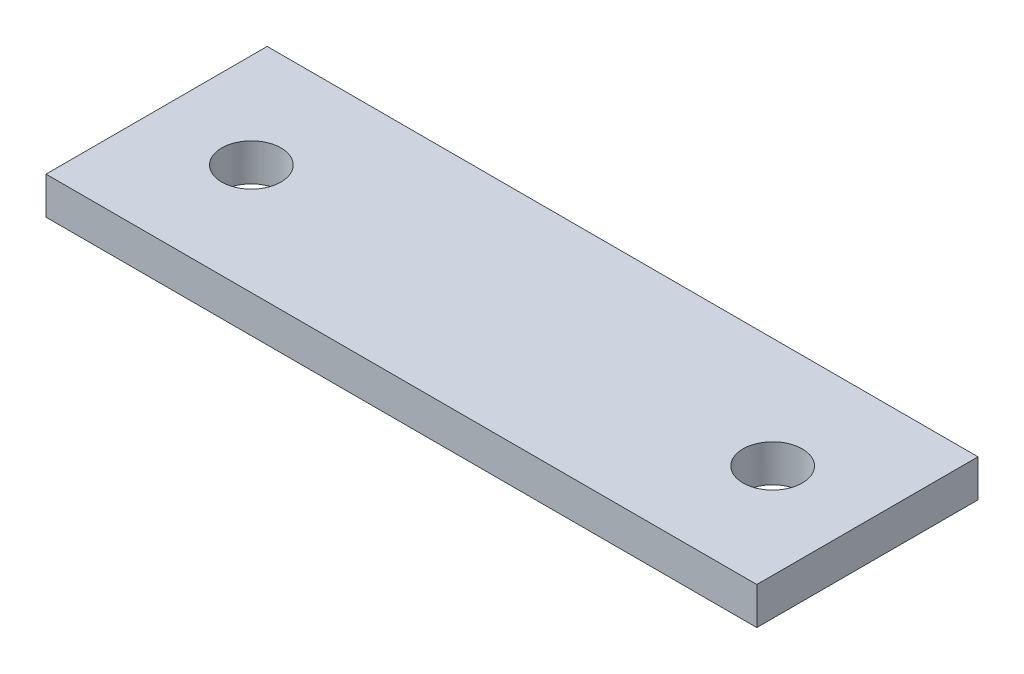
ISO-10303-21;
HEADER;
FILE_DESCRIPTION(('STEP AP214'),'2;1');
FILE_NAME('part.step','',(''),(''),'','','');
FILE_SCHEMA(('AUTOMOTIVE_DESIGN { 1 0 10303 214 1 1 1 1 }'));
ENDSEC;
DATA;
#1=APPLICATION_CONTEXT('core data for automotive mechanical design processes');
#2=APPLICATION_PROTOCOL_DEFINITION('international standard','automotive_design',2000,#1);
#3=PRODUCT_CONTEXT('',#1,'mechanical');
#4=PRODUCT('Part','Part','',(#3));
#5=PRODUCT_RELATED_PRODUCT_CATEGORY('part','',(#4));
#6=PRODUCT_DEFINITION_FORMATION('','',#4);
#7=PRODUCT_DEFINITION_CONTEXT('part definition',#1,'design');
#8=PRODUCT_DEFINITION('design','',#6,#7);
#9=PRODUCT_DEFINITION_SHAPE('','',#8);
#10=(LENGTH_UNIT() NAMED_UNIT(*) SI_UNIT(.MILLI.,.METRE.));
#11=(NAMED_UNIT(*) PLANE_ANGLE_UNIT() SI_UNIT($,.RADIAN.));
#12=(NAMED_UNIT(*) SI_UNIT($,.STERADIAN.) SOLID_ANGLE_UNIT());
#13=UNCERTAINTY_MEASURE_WITH_UNIT(LENGTH_MEASURE(1.E-05),#10,'distance_accuracy_value','');
#14=(GEOMETRIC_REPRESENTATION_CONTEXT(3) GLOBAL_UNCERTAINTY_ASSIGNED_CONTEXT((#13)) GLOBAL_UNIT_ASSIGNED_CONTEXT((#10,
#11,#12)) REPRESENTATION_CONTEXT('',''));
#15=CARTESIAN_POINT('',(0.,0.,0.));
#16=DIRECTION('',(0.,0.,1.));
#17=DIRECTION('',(1.,0.,0.));
#18=AXIS2_PLACEMENT_3D('',#15,#16,#17);
#19=CARTESIAN_POINT('',(0.,3.15,0.));
#20=DIRECTION('',(1.,0.,0.));
#21=DIRECTION('',(0.,0.,-1.));
#22=AXIS2_PLACEMENT_3D('',#19,#20,#21);
#23=PLANE('',#22);
#24=DIRECTION('',(0.,0.,1.));
#25=VECTOR('',#24,1.);
#26=CARTESIAN_POINT('',(0.,0.,0.));
#27=LINE('',#26,#25);
#28=CARTESIAN_POINT('',(0.,0.,-18.67));
#29=VERTEX_POINT('',#28);
#30=CARTESIAN_POINT('',(0.,0.,0.));
#31=VERTEX_POINT('',#30);
#32=EDGE_CURVE('E99',#29,#31,#27,.T.);
#33=ORIENTED_EDGE('',*,*,#32,.T.);
#34=DIRECTION('',(0.,-1.,0.));
#35=VECTOR('',#34,1.);
#36=CARTESIAN_POINT('',(0.,3.15,0.));
#37=LINE('',#36,#35);
#38=CARTESIAN_POINT('',(0.,3.15,0.));
#39=VERTEX_POINT('',#38);
#40=EDGE_CURVE('E11',#39,#31,#37,.T.);
#41=ORIENTED_EDGE('',*,*,#40,.F.);
#42=DIRECTION('',(0.,0.,1.));
#43=VECTOR('',#42,1.);
#44=CARTESIAN_POINT('',(0.,3.15,0.));
#45=LINE('',#44,#43);
#46=CARTESIAN_POINT('',(0.,3.15,-18.67));
#47=VERTEX_POINT('',#46);
#48=EDGE_CURVE('E87',#47,#39,#45,.T.);
#49=ORIENTED_EDGE('',*,*,#48,.F.);
#50=DIRECTION('',(0.,-1.,0.));
#51=VECTOR('',#50,1.);
#52=CARTESIAN_POINT('',(0.,3.15,-18.67));
#53=LINE('',#52,#51);
#54=EDGE_CURVE('E95',#47,#29,#53,.T.);
#55=ORIENTED_EDGE('',*,*,#54,.T.);
#56=EDGE_LOOP('',(#33,#41,#49,#55));
#57=FACE_BOUND('',#56,.T.);
#58=ADVANCED_FACE('F36',(#57),#23,.F.);
#59=CARTESIAN_POINT('',(0.,3.15,0.));
#60=DIRECTION('',(0.,0.,-1.));
#61=DIRECTION('',(-1.,0.,0.));
#62=AXIS2_PLACEMENT_3D('',#59,#60,#61);
#63=PLANE('',#62);
#64=DIRECTION('',(1.,0.,0.));
#65=VECTOR('',#64,1.);
#66=CARTESIAN_POINT('',(0.,0.,0.));
#67=LINE('',#66,#65);
#68=CARTESIAN_POINT('',(60.,0.,0.));
#69=VERTEX_POINT('',#68);
#70=EDGE_CURVE('E91',#31,#69,#67,.T.);
#71=ORIENTED_EDGE('',*,*,#70,.T.);
#72=DIRECTION('',(0.,-1.,0.));
#73=VECTOR('',#72,1.);
#74=CARTESIAN_POINT('',(60.,3.15,0.));
#75=LINE('',#74,#73);
#76=CARTESIAN_POINT('',(60.,3.15,0.));
#77=VERTEX_POINT('',#76);
#78=EDGE_CURVE('E44',#77,#69,#75,.T.);
#79=ORIENTED_EDGE('',*,*,#78,.F.);
#80=DIRECTION('',(1.,0.,0.));
#81=VECTOR('',#80,1.);
#82=CARTESIAN_POINT('',(0.,3.15,0.));
#83=LINE('',#82,#81);
#84=EDGE_CURVE('E82',#39,#77,#83,.T.);
#85=ORIENTED_EDGE('',*,*,#84,.F.);
#86=ORIENTED_EDGE('',*,*,#40,.T.);
#87=EDGE_LOOP('',(#71,#79,#85,#86));
#88=FACE_BOUND('',#87,.T.);
#89=ADVANCED_FACE('F90',(#88),#63,.F.);
#90=CARTESIAN_POINT('',(60.,3.15,0.));
#91=DIRECTION('',(-1.,0.,0.));
#92=DIRECTION('',(0.,0.,1.));
#93=AXIS2_PLACEMENT_3D('',#90,#91,#92);
#94=PLANE('',#93);
#95=DIRECTION('',(0.,0.,-1.));
#96=VECTOR('',#95,1.);
#97=CARTESIAN_POINT('',(60.,0.,0.));
#98=LINE('',#97,#96);
#99=CARTESIAN_POINT('',(60.,0.,-18.67));
#100=VERTEX_POINT('',#99);
#101=EDGE_CURVE('E69',#69,#100,#98,.T.);
#102=ORIENTED_EDGE('',*,*,#101,.T.);
#103=DIRECTION('',(0.,-1.,0.));
#104=VECTOR('',#103,1.);
#105=CARTESIAN_POINT('',(60.,3.15,-18.67));
#106=LINE('',#105,#104);
#107=CARTESIAN_POINT('',(60.,3.15,-18.67));
#108=VERTEX_POINT('',#107);
#109=EDGE_CURVE('E92',#108,#100,#106,.T.);
#110=ORIENTED_EDGE('',*,*,#109,.F.);
#111=DIRECTION('',(0.,0.,-1.));
#112=VECTOR('',#111,1.);
#113=CARTESIAN_POINT('',(60.,3.15,0.));
#114=LINE('',#113,#112);
#115=EDGE_CURVE('E85',#77,#108,#114,.T.);
#116=ORIENTED_EDGE('',*,*,#115,.F.);
#117=ORIENTED_EDGE('',*,*,#78,.T.);
#118=EDGE_LOOP('',(#102,#110,#116,#117));
#119=FACE_BOUND('',#118,.T.);
#120=ADVANCED_FACE('F93',(#119),#94,.F.);
#121=CARTESIAN_POINT('',(0.,3.15,-18.67));
#122=DIRECTION('',(0.,0.,1.));
#123=DIRECTION('',(1.,0.,0.));
#124=AXIS2_PLACEMENT_3D('',#121,#122,#123);
#125=PLANE('',#124);
#126=DIRECTION('',(-1.,0.,0.));
#127=VECTOR('',#126,1.);
#128=CARTESIAN_POINT('',(0.,0.,-18.67));
#129=LINE('',#128,#127);
#130=EDGE_CURVE('E75',#100,#29,#129,.T.);
#131=ORIENTED_EDGE('',*,*,#130,.T.);
#132=ORIENTED_EDGE('',*,*,#54,.F.);
#133=DIRECTION('',(-1.,0.,0.));
#134=VECTOR('',#133,1.);
#135=CARTESIAN_POINT('',(0.,3.15,-18.67));
#136=LINE('',#135,#134);
#137=EDGE_CURVE('E52',#108,#47,#136,.T.);
#138=ORIENTED_EDGE('',*,*,#137,.F.);
#139=ORIENTED_EDGE('',*,*,#109,.T.);
#140=EDGE_LOOP('',(#131,#132,#138,#139));
#141=FACE_BOUND('',#140,.T.);
#142=ADVANCED_FACE('F107',(#141),#125,.F.);
#143=CARTESIAN_POINT('',(0.,3.15,0.));
#144=DIRECTION('',(0.,-1.,0.));
#145=DIRECTION('',(0.,0.,-1.));
#146=AXIS2_PLACEMENT_3D('',#143,#144,#145);
#147=PLANE('',#146);
#148=CARTESIAN_POINT('',(8.00000000000001,3.15,-9.33499999999998));
#149=DIRECTION('',(0.,1.,0.));
#150=DIRECTION('',(0.,0.,1.));
#151=AXIS2_PLACEMENT_3D('',#148,#149,#150);
#152=CIRCLE('',#151,2.5);
#153=CARTESIAN_POINT('',(8.00000000000001,3.15,-6.83499999999998));
#154=VERTEX_POINT('',#153);
#155=EDGE_CURVE('E121',#154,#154,#152,.T.);
#156=ORIENTED_EDGE('',*,*,#155,.F.);
#157=EDGE_LOOP('',(#156));
#158=FACE_BOUND('',#157,.T.);
#159=CARTESIAN_POINT('',(51.9999999999999,3.15,-9.33499999999998));
#160=DIRECTION('',(0.,1.,0.));
#161=DIRECTION('',(0.,0.,1.));
#162=AXIS2_PLACEMENT_3D('',#159,#160,#161);
#163=CIRCLE('',#162,2.5);
#164=CARTESIAN_POINT('',(51.9999999999999,3.15,-6.83499999999998));
#165=VERTEX_POINT('',#164);
#166=EDGE_CURVE('E115',#165,#165,#163,.T.);
#167=ORIENTED_EDGE('',*,*,#166,.F.);
#168=EDGE_LOOP('',(#167));
#169=FACE_BOUND('',#168,.T.);
#170=ORIENTED_EDGE('',*,*,#48,.T.);
#171=ORIENTED_EDGE('',*,*,#84,.T.);
#172=ORIENTED_EDGE('',*,*,#115,.T.);
#173=ORIENTED_EDGE('',*,*,#137,.T.);
#174=EDGE_LOOP('',(#170,#171,#172,#173));
#175=FACE_BOUND('',#174,.T.);
#176=ADVANCED_FACE('F83',(#158,#169,#175),#147,.F.);
#177=CARTESIAN_POINT('',(0.,0.,0.));
#178=DIRECTION('',(0.,-1.,0.));
#179=DIRECTION('',(0.,0.,-1.));
#180=AXIS2_PLACEMENT_3D('',#177,#178,#179);
#181=PLANE('',#180);
#182=CARTESIAN_POINT('',(8.00000000000001,0.,-9.33499999999998));
#183=DIRECTION('',(0.,-1.,0.));
#184=DIRECTION('',(0.,0.,-1.));
#185=AXIS2_PLACEMENT_3D('',#182,#183,#184);
#186=CIRCLE('',#185,2.5);
#187=CARTESIAN_POINT('',(8.00000000000001,0.,-11.835));
#188=VERTEX_POINT('',#187);
#189=EDGE_CURVE('E118',#188,#188,#186,.T.);
#190=ORIENTED_EDGE('',*,*,#189,.F.);
#191=EDGE_LOOP('',(#190));
#192=FACE_BOUND('',#191,.T.);
#193=CARTESIAN_POINT('',(51.9999999999999,0.,-9.33499999999998));
#194=DIRECTION('',(0.,-1.,0.));
#195=DIRECTION('',(0.,0.,-1.));
#196=AXIS2_PLACEMENT_3D('',#193,#194,#195);
#197=CIRCLE('',#196,2.5);
#198=CARTESIAN_POINT('',(51.9999999999999,0.,-11.835));
#199=VERTEX_POINT('',#198);
#200=EDGE_CURVE('E102',#199,#199,#197,.T.);
#201=ORIENTED_EDGE('',*,*,#200,.F.);
#202=EDGE_LOOP('',(#201));
#203=FACE_BOUND('',#202,.T.);
#204=ORIENTED_EDGE('',*,*,#32,.F.);
#205=ORIENTED_EDGE('',*,*,#130,.F.);
#206=ORIENTED_EDGE('',*,*,#101,.F.);
#207=ORIENTED_EDGE('',*,*,#70,.F.);
#208=EDGE_LOOP('',(#204,#205,#206,#207));
#209=FACE_BOUND('',#208,.T.);
#210=ADVANCED_FACE('F110',(#192,#203,#209),#181,.T.);
#211=CARTESIAN_POINT('',(51.9999999999999,3.15,-9.33499999999998));
#212=DIRECTION('',(0.,1.,0.));
#213=DIRECTION('',(0.,0.,1.));
#214=AXIS2_PLACEMENT_3D('',#211,#212,#213);
#215=CYLINDRICAL_SURFACE('',#214,2.5);
#216=ORIENTED_EDGE('',*,*,#166,.T.);
#217=EDGE_LOOP('',(#216));
#218=FACE_BOUND('',#217,.T.);
#219=ORIENTED_EDGE('',*,*,#200,.T.);
#220=EDGE_LOOP('',(#219));
#221=FACE_BOUND('',#220,.T.);
#222=ADVANCED_FACE('F133',(#218,#221),#215,.F.);
#223=CARTESIAN_POINT('',(8.00000000000001,3.15,-9.33499999999998));
#224=DIRECTION('',(0.,1.,0.));
#225=DIRECTION('',(0.,0.,1.));
#226=AXIS2_PLACEMENT_3D('',#223,#224,#225);
#227=CYLINDRICAL_SURFACE('',#226,2.5);
#228=ORIENTED_EDGE('',*,*,#155,.T.);
#229=EDGE_LOOP('',(#228));
#230=FACE_BOUND('',#229,.T.);
#231=ORIENTED_EDGE('',*,*,#189,.T.);
#232=EDGE_LOOP('',(#231));
#233=FACE_BOUND('',#232,.T.);
#234=ADVANCED_FACE('F125',(#230,#233),#227,.F.);
#235=CLOSED_SHELL('',(#58,#89,#120,#142,#176,#210,#222,#234));
#236=MANIFOLD_SOLID_BREP('B2',#235);
#237=ADVANCED_BREP_SHAPE_REPRESENTATION('',(#18,#236),#14);
#238=SHAPE_DEFINITION_REPRESENTATION(#9,#237);
ENDSEC;
END-ISO-10303-21;
